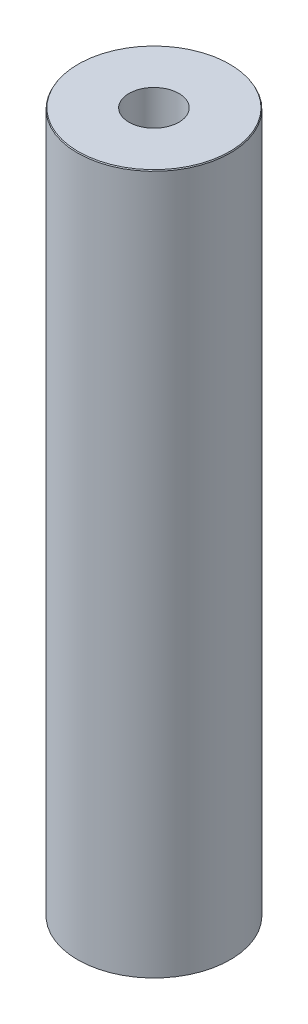
ISO-10303-21;
HEADER;
FILE_DESCRIPTION(('STEP AP214'),'2;1');
FILE_NAME('part.step','',(''),(''),'','','');
FILE_SCHEMA(('AUTOMOTIVE_DESIGN { 1 0 10303 214 1 1 1 1 }'));
ENDSEC;
DATA;
#1=APPLICATION_CONTEXT('core data for automotive mechanical design processes');
#2=APPLICATION_PROTOCOL_DEFINITION('international standard','automotive_design',2000,#1);
#3=PRODUCT_CONTEXT('',#1,'mechanical');
#4=PRODUCT('Part','Part','',(#3));
#5=PRODUCT_RELATED_PRODUCT_CATEGORY('part','',(#4));
#6=PRODUCT_DEFINITION_FORMATION('','',#4);
#7=PRODUCT_DEFINITION_CONTEXT('part definition',#1,'design');
#8=PRODUCT_DEFINITION('design','',#6,#7);
#9=PRODUCT_DEFINITION_SHAPE('','',#8);
#10=(LENGTH_UNIT() NAMED_UNIT(*) SI_UNIT(.MILLI.,.METRE.));
#11=(NAMED_UNIT(*) PLANE_ANGLE_UNIT() SI_UNIT($,.RADIAN.));
#12=(NAMED_UNIT(*) SI_UNIT($,.STERADIAN.) SOLID_ANGLE_UNIT());
#13=UNCERTAINTY_MEASURE_WITH_UNIT(LENGTH_MEASURE(1.E-05),#10,'distance_accuracy_value','');
#14=(GEOMETRIC_REPRESENTATION_CONTEXT(3) GLOBAL_UNCERTAINTY_ASSIGNED_CONTEXT((#13)) GLOBAL_UNIT_ASSIGNED_CONTEXT((#10,
#11,#12)) REPRESENTATION_CONTEXT('',''));
#15=CARTESIAN_POINT('',(0.,0.,0.));
#16=DIRECTION('',(0.,0.,1.));
#17=DIRECTION('',(1.,0.,0.));
#18=AXIS2_PLACEMENT_3D('',#15,#16,#17);
#19=CARTESIAN_POINT('',(0.,183.47770493894,0.));
#20=DIRECTION('',(0.,-1.,0.));
#21=DIRECTION('',(0.,0.,-1.));
#22=AXIS2_PLACEMENT_3D('',#19,#20,#21);
#23=CYLINDRICAL_SURFACE('',#22,20.);
#24=CARTESIAN_POINT('',(0.,183.208729907193,0.));
#25=DIRECTION('',(0.,1.,0.));
#26=DIRECTION('',(0.,0.,1.));
#27=AXIS2_PLACEMENT_3D('',#24,#25,#26);
#28=CIRCLE('',#27,20.);
#29=CARTESIAN_POINT('',(0.,183.208729907193,20.));
#30=VERTEX_POINT('',#29);
#31=EDGE_CURVE('E50',#30,#30,#28,.F.);
#32=ORIENTED_EDGE('',*,*,#31,.T.);
#33=EDGE_LOOP('',(#32));
#34=FACE_BOUND('',#33,.T.);
#35=CARTESIAN_POINT('',(0.,0.155292806984564,0.));
#36=DIRECTION('',(0.,1.,0.));
#37=DIRECTION('',(0.,0.,1.));
#38=AXIS2_PLACEMENT_3D('',#35,#36,#37);
#39=CIRCLE('',#38,20.);
#40=CARTESIAN_POINT('',(0.,0.155292806984564,20.));
#41=VERTEX_POINT('',#40);
#42=EDGE_CURVE('E51',#41,#41,#39,.T.);
#43=ORIENTED_EDGE('',*,*,#42,.T.);
#44=EDGE_LOOP('',(#43));
#45=FACE_BOUND('',#44,.T.);
#46=ADVANCED_FACE('F39',(#34,#45),#23,.T.);
#47=CARTESIAN_POINT('',(0.,183.47770493894,0.));
#48=DIRECTION('',(0.,1.,0.));
#49=DIRECTION('',(0.,0.,1.));
#50=AXIS2_PLACEMENT_3D('',#47,#48,#49);
#51=PLANE('',#50);
#52=CARTESIAN_POINT('',(0.,183.47770493894,0.));
#53=DIRECTION('',(0.,1.,0.));
#54=DIRECTION('',(0.,0.,1.));
#55=AXIS2_PLACEMENT_3D('',#52,#53,#54);
#56=CIRCLE('',#55,19.8447071930155);
#57=CARTESIAN_POINT('',(0.,183.47770493894,19.8447071930155));
#58=VERTEX_POINT('',#57);
#59=EDGE_CURVE('E54',#58,#58,#56,.T.);
#60=ORIENTED_EDGE('',*,*,#59,.T.);
#61=EDGE_LOOP('',(#60));
#62=FACE_BOUND('',#61,.T.);
#63=CARTESIAN_POINT('',(0.,183.47770493894,0.));
#64=DIRECTION('',(0.,1.,0.));
#65=DIRECTION('',(0.,0.,1.));
#66=AXIS2_PLACEMENT_3D('',#63,#64,#65);
#67=CIRCLE('',#66,6.54356139787305);
#68=CARTESIAN_POINT('',(0.,183.47770493894,6.54356139787305));
#69=VERTEX_POINT('',#68);
#70=EDGE_CURVE('E58',#69,#69,#67,.T.);
#71=ORIENTED_EDGE('',*,*,#70,.F.);
#72=EDGE_LOOP('',(#71));
#73=FACE_BOUND('',#72,.T.);
#74=ADVANCED_FACE('F69',(#62,#73),#51,.T.);
#75=CARTESIAN_POINT('',(0.,0.,0.));
#76=DIRECTION('',(0.,1.,0.));
#77=DIRECTION('',(0.,0.,1.));
#78=AXIS2_PLACEMENT_3D('',#75,#76,#77);
#79=PLANE('',#78);
#80=CARTESIAN_POINT('',(0.,0.,0.));
#81=DIRECTION('',(0.,1.,0.));
#82=DIRECTION('',(0.,0.,1.));
#83=AXIS2_PLACEMENT_3D('',#80,#81,#82);
#84=CIRCLE('',#83,19.7310249682527);
#85=CARTESIAN_POINT('',(0.,0.,19.7310249682527));
#86=VERTEX_POINT('',#85);
#87=EDGE_CURVE('E10',#86,#86,#84,.F.);
#88=ORIENTED_EDGE('',*,*,#87,.T.);
#89=EDGE_LOOP('',(#88));
#90=FACE_BOUND('',#89,.T.);
#91=CARTESIAN_POINT('',(0.,0.,0.));
#92=DIRECTION('',(0.,1.,0.));
#93=DIRECTION('',(0.,0.,1.));
#94=AXIS2_PLACEMENT_3D('',#91,#92,#93);
#95=CIRCLE('',#94,6.54356139787305);
#96=CARTESIAN_POINT('',(0.,0.,6.54356139787305));
#97=VERTEX_POINT('',#96);
#98=EDGE_CURVE('E63',#97,#97,#95,.T.);
#99=ORIENTED_EDGE('',*,*,#98,.T.);
#100=EDGE_LOOP('',(#99));
#101=FACE_BOUND('',#100,.T.);
#102=ADVANCED_FACE('F75',(#90,#101),#79,.F.);
#103=CARTESIAN_POINT('',(0.,183.47770493894,0.));
#104=DIRECTION('',(0.,-1.,0.));
#105=DIRECTION('',(0.,0.,-1.));
#106=AXIS2_PLACEMENT_3D('',#103,#104,#105);
#107=CYLINDRICAL_SURFACE('',#106,6.54356139787305);
#108=ORIENTED_EDGE('',*,*,#70,.T.);
#109=EDGE_LOOP('',(#108));
#110=FACE_BOUND('',#109,.T.);
#111=ORIENTED_EDGE('',*,*,#98,.F.);
#112=EDGE_LOOP('',(#111));
#113=FACE_BOUND('',#112,.T.);
#114=ADVANCED_FACE('F70',(#110,#113),#107,.F.);
#115=CARTESIAN_POINT('',(0.,183.47770493894,0.));
#116=DIRECTION('',(0.,-1.,0.));
#117=DIRECTION('',(0.,0.,-1.));
#118=AXIS2_PLACEMENT_3D('',#115,#116,#117);
#119=CONICAL_SURFACE('',#118,19.8447071930155,0.523598775598268);
#120=ORIENTED_EDGE('',*,*,#31,.F.);
#121=EDGE_LOOP('',(#120));
#122=FACE_BOUND('',#121,.T.);
#123=ORIENTED_EDGE('',*,*,#59,.F.);
#124=EDGE_LOOP('',(#123));
#125=FACE_BOUND('',#124,.T.);
#126=ADVANCED_FACE('F81',(#122,#125),#119,.T.);
#127=CARTESIAN_POINT('',(0.,0.155292806984564,0.));
#128=DIRECTION('',(0.,1.,0.));
#129=DIRECTION('',(0.,0.,1.));
#130=AXIS2_PLACEMENT_3D('',#127,#128,#129);
#131=CONICAL_SURFACE('',#130,20.,1.04719755119661);
#132=ORIENTED_EDGE('',*,*,#87,.F.);
#133=EDGE_LOOP('',(#132));
#134=FACE_BOUND('',#133,.T.);
#135=ORIENTED_EDGE('',*,*,#42,.F.);
#136=EDGE_LOOP('',(#135));
#137=FACE_BOUND('',#136,.T.);
#138=ADVANCED_FACE('F45',(#134,#137),#131,.T.);
#139=CLOSED_SHELL('',(#46,#74,#102,#114,#126,#138));
#140=MANIFOLD_SOLID_BREP('B2',#139);
#141=ADVANCED_BREP_SHAPE_REPRESENTATION('',(#18,#140),#14);
#142=SHAPE_DEFINITION_REPRESENTATION(#9,#141);
ENDSEC;
END-ISO-10303-21;
